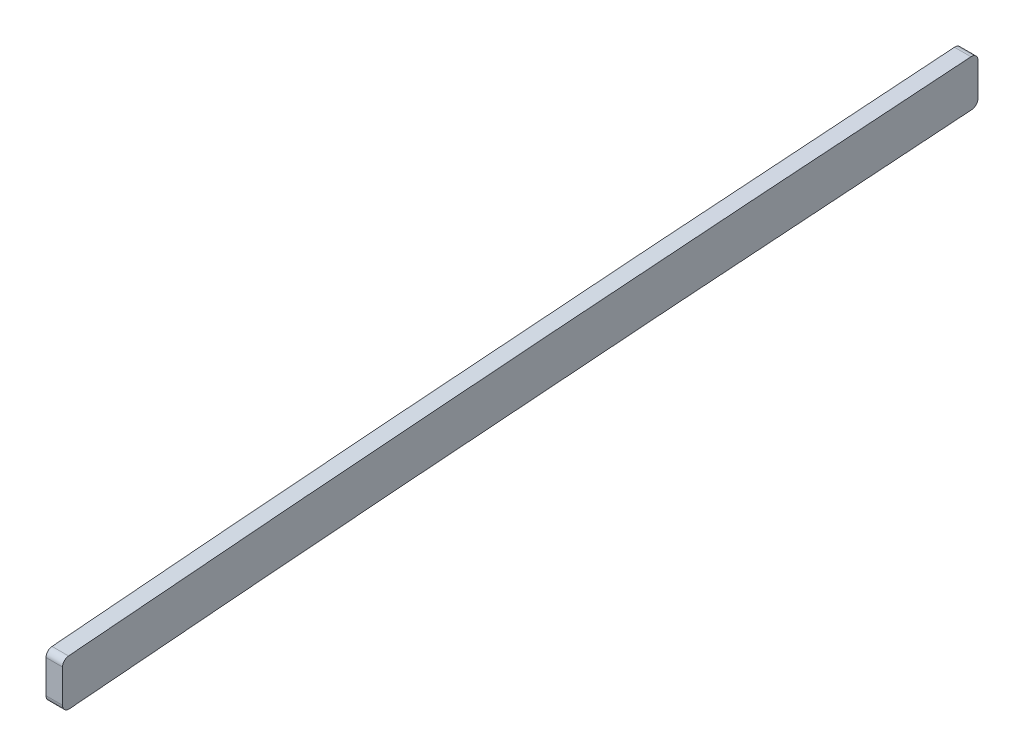
ISO-10303-21;
HEADER;
FILE_DESCRIPTION(('STEP AP214'),'2;1');
FILE_NAME('part.step','',(''),(''),'','','');
FILE_SCHEMA(('AUTOMOTIVE_DESIGN { 1 0 10303 214 1 1 1 1 }'));
ENDSEC;
DATA;
#1=APPLICATION_CONTEXT('core data for automotive mechanical design processes');
#2=APPLICATION_PROTOCOL_DEFINITION('international standard','automotive_design',2000,#1);
#3=PRODUCT_CONTEXT('',#1,'mechanical');
#4=PRODUCT('Part','Part','',(#3));
#5=PRODUCT_RELATED_PRODUCT_CATEGORY('part','',(#4));
#6=PRODUCT_DEFINITION_FORMATION('','',#4);
#7=PRODUCT_DEFINITION_CONTEXT('part definition',#1,'design');
#8=PRODUCT_DEFINITION('design','',#6,#7);
#9=PRODUCT_DEFINITION_SHAPE('','',#8);
#10=(LENGTH_UNIT() NAMED_UNIT(*) SI_UNIT(.MILLI.,.METRE.));
#11=(NAMED_UNIT(*) PLANE_ANGLE_UNIT() SI_UNIT($,.RADIAN.));
#12=(NAMED_UNIT(*) SI_UNIT($,.STERADIAN.) SOLID_ANGLE_UNIT());
#13=UNCERTAINTY_MEASURE_WITH_UNIT(LENGTH_MEASURE(1.E-05),#10,'distance_accuracy_value','');
#14=(GEOMETRIC_REPRESENTATION_CONTEXT(3) GLOBAL_UNCERTAINTY_ASSIGNED_CONTEXT((#13)) GLOBAL_UNIT_ASSIGNED_CONTEXT((#10,
#11,#12)) REPRESENTATION_CONTEXT('',''));
#15=CARTESIAN_POINT('',(0.,0.,0.));
#16=DIRECTION('',(0.,0.,1.));
#17=DIRECTION('',(1.,0.,0.));
#18=AXIS2_PLACEMENT_3D('',#15,#16,#17);
#19=CARTESIAN_POINT('',(1.5875,0.,0.));
#20=DIRECTION('',(1.,0.,0.));
#21=DIRECTION('',(0.,0.,1.));
#22=AXIS2_PLACEMENT_3D('',#19,#20,#21);
#23=PLANE('',#22);
#24=CARTESIAN_POINT('',(1.5875,114.744712211049,1735.36978708818));
#25=CARTESIAN_POINT('',(1.5875,110.735232017816,1815.99594072318));
#26=CARTESIAN_POINT('',(1.5875,104.09636454831,1936.9066504622));
#27=CARTESIAN_POINT('',(1.5875,94.1879787504419,2098.04948516813));
#28=CARTESIAN_POINT('',(1.5875,87.3146385091305,2198.69473672509));
#29=CARTESIAN_POINT('',(1.5875,81.1144189306114,2279.13041374665));
#30=CARTESIAN_POINT('',(1.5875,76.0340766078011,2339.41295030379));
#31=CARTESIAN_POINT('',(1.5875,70.2827054495217,2399.56405433432));
#32=CARTESIAN_POINT('',(1.5875,61.1273782537238,2479.57046826411));
#33=CARTESIAN_POINT('',(1.5875,49.6509076137669,2559.29208787163));
#34=CARTESIAN_POINT('',(1.5875,38.2354847347183,2626.79755458493));
#35=CARTESIAN_POINT('',(1.5875,32.3571302958871,2659.27265183733));
#36=CARTESIAN_POINT('',(1.5875,28.6522110138429,2679.06248770776));
#37=CARTESIAN_POINT('',(1.5875,26.3541994456866,2690.94044026322));
#38=CARTESIAN_POINT('',(1.5875,24.9439248982718,2698.06642332353));
#39=B_SPLINE_CURVE_WITH_KNOTS('',3,(#24,#25,#26,#27,#28,#29,#30,#31,#32,#33,#34,#35,#36,#37,
#38),.UNSPECIFIED.,.F.,.F.,(4,1,1,1,1,1,1,1,1,1,1,1,4),(0.,0.25,0.375,0.5,0.5625,0.625,0.6875,
0.75,0.875,0.9375,0.962410670199827,0.977446402119896,1.),.UNSPECIFIED.);
#40=CARTESIAN_POINT('',(1.5875,91.519678648898,2136.37222712257));
#41=VERTEX_POINT('',#40);
#42=CARTESIAN_POINT('',(1.5875,78.4872851145334,2310.02255532039));
#43=VERTEX_POINT('',#42);
#44=EDGE_CURVE('E236',#41,#43,#39,.T.);
#45=ORIENTED_EDGE('',*,*,#44,.F.);
#46=CARTESIAN_POINT('',(1.5875,92.7868126340687,2136.4575));
#47=DIRECTION('',(-1.,0.,0.));
#48=DIRECTION('',(0.,0.,1.));
#49=AXIS2_PLACEMENT_3D('',#46,#47,#48);
#50=CIRCLE('',#49,1.27);
#51=CARTESIAN_POINT('',(1.5875,92.7868126340687,2135.1875));
#52=VERTEX_POINT('',#51);
#53=EDGE_CURVE('E115',#52,#41,#50,.T.);
#54=ORIENTED_EDGE('',*,*,#53,.F.);
#55=DIRECTION('',(0.,-1.,0.));
#56=VECTOR('',#55,1.);
#57=CARTESIAN_POINT('',(1.5875,0.,2135.1875));
#58=LINE('',#57,#56);
#59=CARTESIAN_POINT('',(1.5875,99.1500427560389,2135.1875));
#60=VERTEX_POINT('',#59);
#61=EDGE_CURVE('E234',#60,#52,#58,.T.);
#62=ORIENTED_EDGE('',*,*,#61,.F.);
#63=CARTESIAN_POINT('',(1.5875,99.1500427560389,2136.4575));
#64=DIRECTION('',(-1.,0.,0.));
#65=DIRECTION('',(0.,0.,1.));
#66=AXIS2_PLACEMENT_3D('',#63,#64,#65);
#67=CIRCLE('',#66,1.27);
#68=CARTESIAN_POINT('',(1.5875,100.41717746977,2136.54276319007));
#69=VERTEX_POINT('',#68);
#70=EDGE_CURVE('E157',#69,#60,#67,.T.);
#71=ORIENTED_EDGE('',*,*,#70,.F.);
#72=CARTESIAN_POINT('',(1.5875,87.387254374734,2310.23735922312));
#73=CARTESIAN_POINT('',(1.5875,87.3934551380196,2310.16427019507));
#74=CARTESIAN_POINT('',(1.5875,87.3996547943512,2310.09118107085));
#75=CARTESIAN_POINT('',(1.5875,88.2588450388707,2299.96017913521));
#76=CARTESIAN_POINT('',(1.5875,89.0908434299724,2289.90044260235));
#77=CARTESIAN_POINT('',(1.5875,91.5298376215323,2259.71628097743));
#78=CARTESIAN_POINT('',(1.5875,93.0801686873999,2239.58699871448));
#79=CARTESIAN_POINT('',(1.5875,96.6188952190012,2191.82395619038));
#80=CARTESIAN_POINT('',(1.5875,98.5571137716093,2164.1860073924));
#81=CARTESIAN_POINT('',(1.5875,100.417177393438,2136.54276318493));
#82=B_SPLINE_CURVE_WITH_KNOTS('',3,(#72,#73,#74,#75,#76,#77,#78,#79,#80,#81),.UNSPECIFIED.,.F.,
.F.,(4,2,2,2,4),(0.414227985667118,0.414455074347842,0.445705074347842,0.508205074347842,
0.593977088680723),.UNSPECIFIED.);
#83=CARTESIAN_POINT('',(1.5875,87.3873581201983,2310.23736802677));
#84=VERTEX_POINT('',#83);
#85=EDGE_CURVE('E128',#69,#84,#82,.F.);
#86=ORIENTED_EDGE('',*,*,#85,.T.);
#87=CARTESIAN_POINT('',(1.5875,86.121800307132,2310.13));
#88=DIRECTION('',(-1.,0.,0.));
#89=DIRECTION('',(0.,0.,1.));
#90=AXIS2_PLACEMENT_3D('',#87,#88,#89);
#91=CIRCLE('',#90,1.27);
#92=CARTESIAN_POINT('',(1.5875,86.121800307132,2311.4));
#93=VERTEX_POINT('',#92);
#94=EDGE_CURVE('E350',#93,#84,#91,.T.);
#95=ORIENTED_EDGE('',*,*,#94,.F.);
#96=DIRECTION('',(0.,1.,0.));
#97=VECTOR('',#96,1.);
#98=CARTESIAN_POINT('',(1.5875,-1.15096295574831E-10,2311.4));
#99=LINE('',#98,#97);
#100=CARTESIAN_POINT('',(1.5875,79.7527319292289,2311.4));
#101=VERTEX_POINT('',#100);
#102=EDGE_CURVE('E167',#101,#93,#99,.T.);
#103=ORIENTED_EDGE('',*,*,#102,.F.);
#104=CARTESIAN_POINT('',(1.5875,79.752731929229,2310.13));
#105=DIRECTION('',(-1.,0.,0.));
#106=DIRECTION('',(0.,0.,1.));
#107=AXIS2_PLACEMENT_3D('',#104,#105,#106);
#108=CIRCLE('',#107,1.27);
#109=EDGE_CURVE('E247',#43,#101,#108,.T.);
#110=ORIENTED_EDGE('',*,*,#109,.F.);
#111=EDGE_LOOP('',(#45,#54,#62,#71,#86,#95,#103,#110));
#112=FACE_BOUND('',#111,.T.);
#113=ADVANCED_FACE('F43',(#112),#23,.T.);
#114=CARTESIAN_POINT('',(-1.5875,0.,0.));
#115=DIRECTION('',(1.,0.,0.));
#116=DIRECTION('',(0.,0.,1.));
#117=AXIS2_PLACEMENT_3D('',#114,#115,#116);
#118=PLANE('',#117);
#119=DIRECTION('',(0.,1.,0.));
#120=VECTOR('',#119,1.);
#121=CARTESIAN_POINT('',(-1.5875,-1.15096295574831E-10,2311.4));
#122=LINE('',#121,#120);
#123=CARTESIAN_POINT('',(-1.5875,79.7527319292289,2311.4));
#124=VERTEX_POINT('',#123);
#125=CARTESIAN_POINT('',(-1.5875,86.121800307132,2311.4));
#126=VERTEX_POINT('',#125);
#127=EDGE_CURVE('E162',#124,#126,#122,.T.);
#128=ORIENTED_EDGE('',*,*,#127,.T.);
#129=CARTESIAN_POINT('',(-1.5875,86.121800307132,2310.13));
#130=DIRECTION('',(-1.,0.,0.));
#131=DIRECTION('',(0.,0.,1.));
#132=AXIS2_PLACEMENT_3D('',#129,#130,#131);
#133=CIRCLE('',#132,1.27);
#134=CARTESIAN_POINT('',(-1.5875,87.3873576545853,2310.23736798927));
#135=VERTEX_POINT('',#134);
#136=EDGE_CURVE('E135',#135,#126,#133,.F.);
#137=ORIENTED_EDGE('',*,*,#136,.F.);
#138=CARTESIAN_POINT('',(-1.5875,100.417177393438,2136.54276318492));
#139=CARTESIAN_POINT('',(-1.5875,98.5571137716097,2164.18600739239));
#140=CARTESIAN_POINT('',(-1.5875,96.6188952190014,2191.82395619037));
#141=CARTESIAN_POINT('',(-1.5875,93.0801686873999,2239.58699871448));
#142=CARTESIAN_POINT('',(-1.5875,91.5298376215323,2259.71628097743));
#143=CARTESIAN_POINT('',(-1.5875,89.0908434299724,2289.90044260235));
#144=CARTESIAN_POINT('',(-1.5875,88.2588450388707,2299.96017913521));
#145=CARTESIAN_POINT('',(-1.5875,87.399654794238,2310.09118107218));
#146=CARTESIAN_POINT('',(-1.5875,87.3934551377931,2310.16427019774));
#147=CARTESIAN_POINT('',(-1.5875,87.387254374394,2310.23735922713));
#148=B_SPLINE_CURVE_WITH_KNOTS('',3,(#138,#139,#140,#141,#142,#143,#144,#145,#146,#147),
.UNSPECIFIED.,.F.,.F.,(4,2,2,2,4),(0.41422798566711,0.5,0.5625,0.59375,0.593977088684873),.UNSPECIFIED.);
#149=CARTESIAN_POINT('',(-1.5875,100.417176047924,2136.54276309439));
#150=VERTEX_POINT('',#149);
#151=EDGE_CURVE('E129',#150,#135,#148,.T.);
#152=ORIENTED_EDGE('',*,*,#151,.F.);
#153=CARTESIAN_POINT('',(-1.5875,99.1500427560389,2136.4575));
#154=DIRECTION('',(-1.,0.,0.));
#155=DIRECTION('',(0.,0.,1.));
#156=AXIS2_PLACEMENT_3D('',#153,#154,#155);
#157=CIRCLE('',#156,1.27);
#158=CARTESIAN_POINT('',(-1.5875,99.1500427560389,2135.1875));
#159=VERTEX_POINT('',#158);
#160=EDGE_CURVE('E136',#159,#150,#157,.F.);
#161=ORIENTED_EDGE('',*,*,#160,.F.);
#162=DIRECTION('',(0.,-1.,0.));
#163=VECTOR('',#162,1.);
#164=CARTESIAN_POINT('',(-1.5875,0.,2135.1875));
#165=LINE('',#164,#163);
#166=CARTESIAN_POINT('',(-1.5875,92.7868126340687,2135.1875));
#167=VERTEX_POINT('',#166);
#168=EDGE_CURVE('E120',#159,#167,#165,.T.);
#169=ORIENTED_EDGE('',*,*,#168,.T.);
#170=CARTESIAN_POINT('',(-1.5875,92.7868126340687,2136.4575));
#171=DIRECTION('',(-1.,0.,0.));
#172=DIRECTION('',(0.,0.,1.));
#173=AXIS2_PLACEMENT_3D('',#170,#171,#172);
#174=CIRCLE('',#173,1.27);
#175=CARTESIAN_POINT('',(-1.5875,91.519678648898,2136.37222712257));
#176=VERTEX_POINT('',#175);
#177=EDGE_CURVE('E112',#176,#167,#174,.F.);
#178=ORIENTED_EDGE('',*,*,#177,.F.);
#179=CARTESIAN_POINT('',(-1.5875,114.744712211049,1735.36978708818));
#180=CARTESIAN_POINT('',(-1.5875,110.735232017816,1815.99594072318));
#181=CARTESIAN_POINT('',(-1.5875,104.09636454831,1936.9066504622));
#182=CARTESIAN_POINT('',(-1.5875,94.1879787504419,2098.04948516813));
#183=CARTESIAN_POINT('',(-1.5875,87.3146385091305,2198.69473672509));
#184=CARTESIAN_POINT('',(-1.5875,81.1144189306114,2279.13041374665));
#185=CARTESIAN_POINT('',(-1.5875,76.0340766078011,2339.41295030379));
#186=CARTESIAN_POINT('',(-1.5875,70.2827054495217,2399.56405433432));
#187=CARTESIAN_POINT('',(-1.5875,61.1273782537238,2479.57046826411));
#188=CARTESIAN_POINT('',(-1.5875,49.6509076137669,2559.29208787163));
#189=CARTESIAN_POINT('',(-1.5875,38.2354847347183,2626.79755458493));
#190=CARTESIAN_POINT('',(-1.5875,32.3571302958871,2659.27265183733));
#191=CARTESIAN_POINT('',(-1.5875,28.6522110138429,2679.06248770776));
#192=CARTESIAN_POINT('',(-1.5875,26.3541994456866,2690.94044026322));
#193=CARTESIAN_POINT('',(-1.5875,24.9439248982718,2698.06642332353));
#194=B_SPLINE_CURVE_WITH_KNOTS('',3,(#179,#180,#181,#182,#183,#184,#185,#186,#187,#188,#189,
#190,#191,#192,#193),.UNSPECIFIED.,.F.,.F.,(4,1,1,1,1,1,1,1,1,1,1,1,4),(0.,0.25,0.375,0.5,
0.5625,0.625,0.6875,0.75,0.875,0.9375,0.962410670199827,0.977446402119896,1.),.UNSPECIFIED.);
#195=CARTESIAN_POINT('',(-1.5875,78.4872851145334,2310.02255532039));
#196=VERTEX_POINT('',#195);
#197=EDGE_CURVE('E123',#176,#196,#194,.T.);
#198=ORIENTED_EDGE('',*,*,#197,.T.);
#199=CARTESIAN_POINT('',(-1.5875,79.752731929229,2310.13));
#200=DIRECTION('',(-1.,0.,0.));
#201=DIRECTION('',(0.,0.,1.));
#202=AXIS2_PLACEMENT_3D('',#199,#200,#201);
#203=CIRCLE('',#202,1.27);
#204=EDGE_CURVE('E138',#124,#196,#203,.F.);
#205=ORIENTED_EDGE('',*,*,#204,.F.);
#206=EDGE_LOOP('',(#128,#137,#152,#161,#169,#178,#198,#205));
#207=FACE_BOUND('',#206,.T.);
#208=ADVANCED_FACE('F132',(#207),#118,.F.);
#209=DIRECTION('',(1.,0.,0.));
#210=VECTOR('',#209,1.);
#211=SURFACE_OF_LINEAR_EXTRUSION('',#194,#210);
#212=ORIENTED_EDGE('',*,*,#197,.F.);
#213=DIRECTION('',(1.,0.,0.));
#214=VECTOR('',#213,1.);
#215=CARTESIAN_POINT('',(1.5875,91.519678648898,2136.37222712257));
#216=LINE('',#215,#214);
#217=EDGE_CURVE('E108',#41,#176,#216,.F.);
#218=ORIENTED_EDGE('',*,*,#217,.F.);
#219=ORIENTED_EDGE('',*,*,#44,.T.);
#220=DIRECTION('',(1.,0.,0.));
#221=VECTOR('',#220,1.);
#222=CARTESIAN_POINT('',(-1.5875,78.4872851145334,2310.02255532039));
#223=LINE('',#222,#221);
#224=EDGE_CURVE('E119',#196,#43,#223,.T.);
#225=ORIENTED_EDGE('',*,*,#224,.F.);
#226=EDGE_LOOP('',(#212,#218,#219,#225));
#227=FACE_BOUND('',#226,.T.);
#228=ADVANCED_FACE('F124',(#227),#211,.F.);
#229=CARTESIAN_POINT('',(-1.5875,123.62374006878,1735.81133470922));
#230=CARTESIAN_POINT('',(-1.5875,121.618292624347,1776.13863549866));
#231=CARTESIAN_POINT('',(-1.5875,119.500621805793,1816.46028157928));
#232=CARTESIAN_POINT('',(-1.5875,115.087561884835,1897.09366867468));
#233=CARTESIAN_POINT('',(-1.5875,112.792971084113,1937.4056388964));
#234=CARTESIAN_POINT('',(-1.5875,108.01836652323,2018.0184190449));
#235=CARTESIAN_POINT('',(-1.5875,105.539122976217,2058.31951222306));
#236=CARTESIAN_POINT('',(-1.5875,100.307240032155,2138.90378014414));
#237=CARTESIAN_POINT('',(-1.5875,97.5551279550714,2179.18739792965));
#238=CARTESIAN_POINT('',(-1.5875,93.0801686873999,2239.58699871448));
#239=CARTESIAN_POINT('',(-1.5875,91.5298376215323,2259.71628097743));
#240=CARTESIAN_POINT('',(-1.5875,89.0908434299724,2289.90044260235));
#241=CARTESIAN_POINT('',(-1.5875,88.2588450388707,2299.96017913521));
#242=CARTESIAN_POINT('',(-1.5875,86.5528616543479,2320.0760045662));
#243=CARTESIAN_POINT('',(-1.5875,85.6789622226699,2330.13210089761));
#244=CARTESIAN_POINT('',(-1.5875,83.8743348466212,2350.23935651754));
#245=CARTESIAN_POINT('',(-1.5875,82.9433074844211,2360.29048979378));
#246=CARTESIAN_POINT('',(-1.5875,81.0031832968026,2380.3859739712));
#247=CARTESIAN_POINT('',(-1.5875,79.9934185550902,2390.43006537759));
#248=CARTESIAN_POINT('',(-1.5875,76.8275775323524,2420.5470261948));
#249=CARTESIAN_POINT('',(-1.5875,74.5336729547823,2440.6064858901));
#250=CARTESIAN_POINT('',(-1.5875,69.5562785225382,2480.67556956821));
#251=CARTESIAN_POINT('',(-1.5875,66.8741508113434,2500.6871518296));
#252=CARTESIAN_POINT('',(-1.5875,61.1502462952664,2540.65429020717));
#253=CARTESIAN_POINT('',(-1.5875,58.1097556460363,2560.61102642776));
#254=CARTESIAN_POINT('',(-1.5875,51.7024655740435,2600.47545713133));
#255=CARTESIAN_POINT('',(-1.5875,48.3375388880153,2620.38296708947));
#256=CARTESIAN_POINT('',(-1.5875,43.0416957000558,2650.1996164959));
#257=CARTESIAN_POINT('',(-1.5875,41.2345222277721,2660.13118962649));
#258=CARTESIAN_POINT('',(-1.5875,37.5258634945269,2679.97612471736));
#259=CARTESIAN_POINT('',(-1.5875,35.6245635215631,2689.88973979233));
#260=CARTESIAN_POINT('',(-1.5875,33.6647813022258,2699.79233281757));
#261=B_SPLINE_CURVE_WITH_KNOTS('',3,(#229,#230,#231,#232,#233,#234,#235,#236,#237,#238,#239,
#240,#241,#242,#243,#244,#245,#246,#247,#248,#249,#250,#251,#252,#253,#254,#255,#256,#257,#258,
#259,#260),.UNSPECIFIED.,.F.,.F.,(4,2,2,2,2,2,2,2,2,2,2,2,2,2,2,4),(0.,0.125,0.25,0.375,0.5,
0.5625,0.59375,0.625,0.65625,0.6875,0.75,0.8125,0.875,0.9375,0.96875,1.),.UNSPECIFIED.);
#262=DIRECTION('',(1.,0.,0.));
#263=VECTOR('',#262,1.);
#264=SURFACE_OF_LINEAR_EXTRUSION('',#261,#263);
#265=ORIENTED_EDGE('',*,*,#85,.F.);
#266=DIRECTION('',(1.,0.,0.));
#267=VECTOR('',#266,1.);
#268=CARTESIAN_POINT('',(-1.5875,100.417177393438,2136.54276318493));
#269=LINE('',#268,#267);
#270=EDGE_CURVE('E65',#150,#69,#269,.T.);
#271=ORIENTED_EDGE('',*,*,#270,.F.);
#272=ORIENTED_EDGE('',*,*,#151,.T.);
#273=DIRECTION('',(1.,0.,0.));
#274=VECTOR('',#273,1.);
#275=CARTESIAN_POINT('',(1.5875,87.3872543749054,2310.2373592211));
#276=LINE('',#275,#274);
#277=EDGE_CURVE('E58',#84,#135,#276,.F.);
#278=ORIENTED_EDGE('',*,*,#277,.F.);
#279=EDGE_LOOP('',(#265,#271,#272,#278));
#280=FACE_BOUND('',#279,.T.);
#281=ADVANCED_FACE('F197',(#280),#264,.T.);
#282=CARTESIAN_POINT('',(-1.59250269714593,-1.15096295574831E-10,2311.4));
#283=DIRECTION('',(0.,0.,1.));
#284=DIRECTION('',(0.,1.,0.));
#285=AXIS2_PLACEMENT_3D('',#282,#283,#284);
#286=PLANE('',#285);
#287=ORIENTED_EDGE('',*,*,#102,.T.);
#288=DIRECTION('',(-1.,0.,0.));
#289=VECTOR('',#288,1.);
#290=CARTESIAN_POINT('',(1.5875,86.121800307132,2311.4));
#291=LINE('',#290,#289);
#292=EDGE_CURVE('E249',#126,#93,#291,.F.);
#293=ORIENTED_EDGE('',*,*,#292,.F.);
#294=ORIENTED_EDGE('',*,*,#127,.F.);
#295=DIRECTION('',(1.,0.,0.));
#296=VECTOR('',#295,1.);
#297=CARTESIAN_POINT('',(-1.59250269714593,79.7527319292289,2311.4));
#298=LINE('',#297,#296);
#299=EDGE_CURVE('E140',#101,#124,#298,.F.);
#300=ORIENTED_EDGE('',*,*,#299,.F.);
#301=EDGE_LOOP('',(#287,#293,#294,#300));
#302=FACE_BOUND('',#301,.T.);
#303=ADVANCED_FACE('F194',(#302),#286,.T.);
#304=CARTESIAN_POINT('',(-1.59250269714593,0.,2135.1875));
#305=DIRECTION('',(0.,0.,-1.));
#306=DIRECTION('',(1.,0.,0.));
#307=AXIS2_PLACEMENT_3D('',#304,#305,#306);
#308=PLANE('',#307);
#309=ORIENTED_EDGE('',*,*,#168,.F.);
#310=DIRECTION('',(-1.,0.,0.));
#311=VECTOR('',#310,1.);
#312=CARTESIAN_POINT('',(-1.59250269714593,99.1500427560389,2135.1875));
#313=LINE('',#312,#311);
#314=EDGE_CURVE('E51',#60,#159,#313,.T.);
#315=ORIENTED_EDGE('',*,*,#314,.F.);
#316=ORIENTED_EDGE('',*,*,#61,.T.);
#317=DIRECTION('',(1.,0.,0.));
#318=VECTOR('',#317,1.);
#319=CARTESIAN_POINT('',(-1.59250269714593,92.7868126340687,2135.1875));
#320=LINE('',#319,#318);
#321=EDGE_CURVE('E11',#167,#52,#320,.T.);
#322=ORIENTED_EDGE('',*,*,#321,.F.);
#323=EDGE_LOOP('',(#309,#315,#316,#322));
#324=FACE_BOUND('',#323,.T.);
#325=ADVANCED_FACE('F161',(#324),#308,.T.);
#326=CARTESIAN_POINT('',(0.,79.752731929229,2310.13));
#327=DIRECTION('',(1.,0.,0.));
#328=DIRECTION('',(0.,0.,1.));
#329=AXIS2_PLACEMENT_3D('',#326,#327,#328);
#330=CYLINDRICAL_SURFACE('',#329,1.27);
#331=ORIENTED_EDGE('',*,*,#204,.T.);
#332=ORIENTED_EDGE('',*,*,#224,.T.);
#333=ORIENTED_EDGE('',*,*,#109,.T.);
#334=ORIENTED_EDGE('',*,*,#299,.T.);
#335=EDGE_LOOP('',(#331,#332,#333,#334));
#336=FACE_BOUND('',#335,.T.);
#337=ADVANCED_FACE('F201',(#336),#330,.T.);
#338=CARTESIAN_POINT('',(-0.00250134857296565,86.121800307132,2310.13));
#339=DIRECTION('',(1.,0.,0.));
#340=DIRECTION('',(0.,0.,1.));
#341=AXIS2_PLACEMENT_3D('',#338,#339,#340);
#342=CYLINDRICAL_SURFACE('',#341,1.27);
#343=ORIENTED_EDGE('',*,*,#136,.T.);
#344=ORIENTED_EDGE('',*,*,#292,.T.);
#345=ORIENTED_EDGE('',*,*,#94,.T.);
#346=ORIENTED_EDGE('',*,*,#277,.T.);
#347=EDGE_LOOP('',(#343,#344,#345,#346));
#348=FACE_BOUND('',#347,.T.);
#349=ADVANCED_FACE('F255',(#348),#342,.T.);
#350=CARTESIAN_POINT('',(0.,92.7868126340687,2136.4575));
#351=DIRECTION('',(1.,0.,0.));
#352=DIRECTION('',(0.,0.,1.));
#353=AXIS2_PLACEMENT_3D('',#350,#351,#352);
#354=CYLINDRICAL_SURFACE('',#353,1.27);
#355=ORIENTED_EDGE('',*,*,#177,.T.);
#356=ORIENTED_EDGE('',*,*,#321,.T.);
#357=ORIENTED_EDGE('',*,*,#53,.T.);
#358=ORIENTED_EDGE('',*,*,#217,.T.);
#359=EDGE_LOOP('',(#355,#356,#357,#358));
#360=FACE_BOUND('',#359,.T.);
#361=ADVANCED_FACE('F110',(#360),#354,.T.);
#362=CARTESIAN_POINT('',(-0.00250134857296565,99.1500427560389,2136.4575));
#363=DIRECTION('',(1.,0.,0.));
#364=DIRECTION('',(0.,0.,1.));
#365=AXIS2_PLACEMENT_3D('',#362,#363,#364);
#366=CYLINDRICAL_SURFACE('',#365,1.27);
#367=ORIENTED_EDGE('',*,*,#160,.T.);
#368=ORIENTED_EDGE('',*,*,#270,.T.);
#369=ORIENTED_EDGE('',*,*,#70,.T.);
#370=ORIENTED_EDGE('',*,*,#314,.T.);
#371=EDGE_LOOP('',(#367,#368,#369,#370));
#372=FACE_BOUND('',#371,.T.);
#373=ADVANCED_FACE('F45',(#372),#366,.T.);
#374=CLOSED_SHELL('',(#113,#208,#228,#281,#303,#325,#337,#349,#361,#373));
#375=MANIFOLD_SOLID_BREP('B2',#374);
#376=ADVANCED_BREP_SHAPE_REPRESENTATION('',(#18,#375),#14);
#377=SHAPE_DEFINITION_REPRESENTATION(#9,#376);
ENDSEC;
END-ISO-10303-21;
